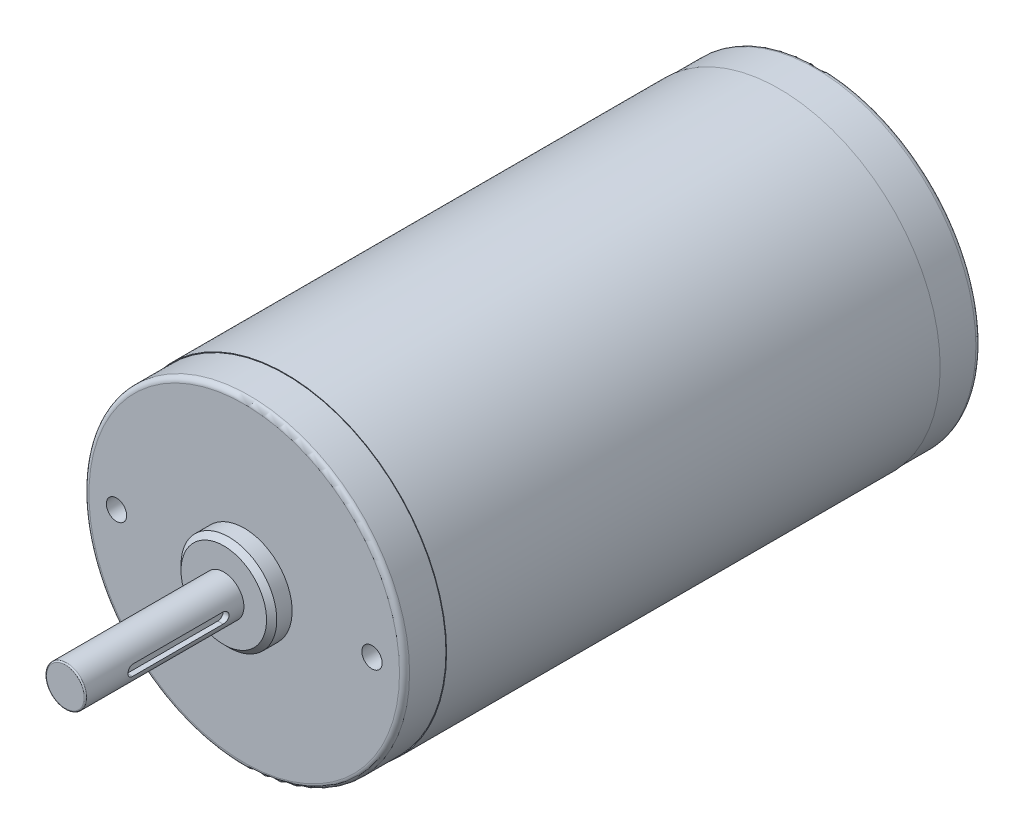
ISO-10303-21;
HEADER;
FILE_DESCRIPTION(('STEP AP214'),'2;1');
FILE_NAME('part.step','',(''),(''),'','','');
FILE_SCHEMA(('AUTOMOTIVE_DESIGN { 1 0 10303 214 1 1 1 1 }'));
ENDSEC;
DATA;
#1=APPLICATION_CONTEXT('core data for automotive mechanical design processes');
#2=APPLICATION_PROTOCOL_DEFINITION('international standard','automotive_design',2000,#1);
#3=PRODUCT_CONTEXT('',#1,'mechanical');
#4=PRODUCT('Part','Part','',(#3));
#5=PRODUCT_RELATED_PRODUCT_CATEGORY('part','',(#4));
#6=PRODUCT_DEFINITION_FORMATION('','',#4);
#7=PRODUCT_DEFINITION_CONTEXT('part definition',#1,'design');
#8=PRODUCT_DEFINITION('design','',#6,#7);
#9=PRODUCT_DEFINITION_SHAPE('','',#8);
#10=(LENGTH_UNIT() NAMED_UNIT(*) SI_UNIT(.MILLI.,.METRE.));
#11=(NAMED_UNIT(*) PLANE_ANGLE_UNIT() SI_UNIT($,.RADIAN.));
#12=(NAMED_UNIT(*) SI_UNIT($,.STERADIAN.) SOLID_ANGLE_UNIT());
#13=UNCERTAINTY_MEASURE_WITH_UNIT(LENGTH_MEASURE(1.E-05),#10,'distance_accuracy_value','');
#14=(GEOMETRIC_REPRESENTATION_CONTEXT(3) GLOBAL_UNCERTAINTY_ASSIGNED_CONTEXT((#13)) GLOBAL_UNIT_ASSIGNED_CONTEXT((#10,
#11,#12)) REPRESENTATION_CONTEXT('',''));
#15=CARTESIAN_POINT('',(0.,0.,0.));
#16=DIRECTION('',(0.,0.,1.));
#17=DIRECTION('',(1.,0.,0.));
#18=AXIS2_PLACEMENT_3D('',#15,#16,#17);
#19=CARTESIAN_POINT('',(35.56,109.2962,54.614));
#20=DIRECTION('',(0.,0.,1.));
#21=DIRECTION('',(1.,0.,0.));
#22=AXIS2_PLACEMENT_3D('',#19,#20,#21);
#23=PLANE('',#22);
#24=CARTESIAN_POINT('',(35.56,109.2962,54.614));
#25=DIRECTION('',(0.,0.,-1.));
#26=DIRECTION('',(1.,0.,0.));
#27=AXIS2_PLACEMENT_3D('',#24,#25,#26);
#28=CIRCLE('',#27,3.74600000000008);
#29=CARTESIAN_POINT('',(39.3060000000001,109.2962,54.614));
#30=VERTEX_POINT('',#29);
#31=EDGE_CURVE('E74',#30,#30,#28,.T.);
#32=ORIENTED_EDGE('',*,*,#31,.F.);
#33=EDGE_LOOP('',(#32));
#34=FACE_BOUND('',#33,.T.);
#35=ADVANCED_FACE('F16',(#34),#23,.T.);
#36=CARTESIAN_POINT('',(38.3600000000001,109.2962,16.4984772078548));
#37=DIRECTION('',(1.,0.,0.));
#38=DIRECTION('',(0.,0.,-1.));
#39=AXIS2_PLACEMENT_3D('',#36,#37,#38);
#40=PLANE('',#39);
#41=CARTESIAN_POINT('',(38.3600000000001,109.2962,27.1));
#42=DIRECTION('',(-1.,0.,0.));
#43=DIRECTION('',(0.,0.,1.));
#44=AXIS2_PLACEMENT_3D('',#41,#42,#43);
#45=CIRCLE('',#44,1.05);
#46=CARTESIAN_POINT('',(38.3600000000001,108.2462,27.1));
#47=VERTEX_POINT('',#46);
#48=CARTESIAN_POINT('',(38.3600000000001,110.3462,27.1));
#49=VERTEX_POINT('',#48);
#50=EDGE_CURVE('E666',#47,#49,#45,.F.);
#51=ORIENTED_EDGE('',*,*,#50,.T.);
#52=DIRECTION('',(0.,0.,1.));
#53=VECTOR('',#52,1.);
#54=CARTESIAN_POINT('',(38.3600000000001,110.3462,16.4984772078548));
#55=LINE('',#54,#53);
#56=CARTESIAN_POINT('',(38.3600000000001,110.3462,45.1));
#57=VERTEX_POINT('',#56);
#58=EDGE_CURVE('E57',#49,#57,#55,.T.);
#59=ORIENTED_EDGE('',*,*,#58,.T.);
#60=CARTESIAN_POINT('',(38.3600000000001,109.2962,45.1));
#61=DIRECTION('',(-1.,0.,0.));
#62=DIRECTION('',(0.,0.,1.));
#63=AXIS2_PLACEMENT_3D('',#60,#61,#62);
#64=CIRCLE('',#63,1.05);
#65=CARTESIAN_POINT('',(38.3600000000001,108.2462,45.1));
#66=VERTEX_POINT('',#65);
#67=EDGE_CURVE('E20',#57,#66,#64,.F.);
#68=ORIENTED_EDGE('',*,*,#67,.T.);
#69=DIRECTION('',(0.,0.,1.));
#70=VECTOR('',#69,1.);
#71=CARTESIAN_POINT('',(38.3600000000001,108.2462,16.4984772078548));
#72=LINE('',#71,#70);
#73=EDGE_CURVE('E61',#47,#66,#72,.T.);
#74=ORIENTED_EDGE('',*,*,#73,.F.);
#75=EDGE_LOOP('',(#51,#59,#68,#74));
#76=FACE_BOUND('',#75,.T.);
#77=ADVANCED_FACE('F60',(#76),#40,.T.);
#78=CARTESIAN_POINT('',(35.56,109.2962,54.36));
#79=DIRECTION('',(0.,0.,1.));
#80=DIRECTION('',(1.,0.,0.));
#81=AXIS2_PLACEMENT_3D('',#78,#79,#80);
#82=TOROIDAL_SURFACE('',#81,3.74600000000008,0.254);
#83=ORIENTED_EDGE('',*,*,#31,.T.);
#84=EDGE_LOOP('',(#83));
#85=FACE_BOUND('',#84,.T.);
#86=CARTESIAN_POINT('',(35.56,109.2962,54.36));
#87=DIRECTION('',(0.,0.,-1.));
#88=DIRECTION('',(-1.,0.,0.));
#89=AXIS2_PLACEMENT_3D('',#86,#87,#88);
#90=CIRCLE('',#89,4.00000000000007);
#91=CARTESIAN_POINT('',(31.5599999999999,109.2962,54.36));
#92=VERTEX_POINT('',#91);
#93=EDGE_CURVE('E671',#92,#92,#90,.T.);
#94=ORIENTED_EDGE('',*,*,#93,.F.);
#95=EDGE_LOOP('',(#94));
#96=FACE_BOUND('',#95,.T.);
#97=ADVANCED_FACE('F87',(#85,#96),#82,.T.);
#98=CARTESIAN_POINT('',(38.3600000000001,108.2462,16.4984772078548));
#99=DIRECTION('',(0.,1.,0.));
#100=DIRECTION('',(0.,0.,1.));
#101=AXIS2_PLACEMENT_3D('',#98,#99,#100);
#102=PLANE('',#101);
#103=DIRECTION('',(0.,0.,-1.));
#104=VECTOR('',#103,1.);
#105=CARTESIAN_POINT('',(39.4197279696891,108.2462,54.614));
#106=LINE('',#105,#104);
#107=CARTESIAN_POINT('',(39.4197279696891,108.2462,27.1));
#108=VERTEX_POINT('',#107);
#109=CARTESIAN_POINT('',(39.4197279696891,108.2462,45.1));
#110=VERTEX_POINT('',#109);
#111=EDGE_CURVE('E673',#108,#110,#106,.F.);
#112=ORIENTED_EDGE('',*,*,#111,.F.);
#113=DIRECTION('',(-1.,0.,0.));
#114=VECTOR('',#113,1.);
#115=CARTESIAN_POINT('',(38.3600000000001,108.2462,27.1));
#116=LINE('',#115,#114);
#117=EDGE_CURVE('E72',#108,#47,#116,.T.);
#118=ORIENTED_EDGE('',*,*,#117,.T.);
#119=ORIENTED_EDGE('',*,*,#73,.T.);
#120=DIRECTION('',(1.,0.,0.));
#121=VECTOR('',#120,1.);
#122=CARTESIAN_POINT('',(38.3600000000001,108.2462,45.1));
#123=LINE('',#122,#121);
#124=EDGE_CURVE('E66',#66,#110,#123,.T.);
#125=ORIENTED_EDGE('',*,*,#124,.T.);
#126=EDGE_LOOP('',(#112,#118,#119,#125));
#127=FACE_BOUND('',#126,.T.);
#128=ADVANCED_FACE('F69',(#127),#102,.T.);
#129=CARTESIAN_POINT('',(38.3600000000001,109.2962,45.1));
#130=DIRECTION('',(-1.,0.,0.));
#131=DIRECTION('',(0.,0.,1.));
#132=AXIS2_PLACEMENT_3D('',#129,#130,#131);
#133=CYLINDRICAL_SURFACE('',#132,1.05);
#134=DIRECTION('',(1.,0.,0.));
#135=VECTOR('',#134,1.);
#136=CARTESIAN_POINT('',(38.3600000000001,110.3462,45.1));
#137=LINE('',#136,#135);
#138=CARTESIAN_POINT('',(39.4197279696891,110.3462,45.1));
#139=VERTEX_POINT('',#138);
#140=EDGE_CURVE('E82',#57,#139,#137,.T.);
#141=ORIENTED_EDGE('',*,*,#140,.T.);
#142=CARTESIAN_POINT('',(39.4197279696891,108.2462,45.1));
#143=CARTESIAN_POINT('',(39.4197258950768,108.24619958975,45.1289948990377));
#144=CARTESIAN_POINT('',(39.4200551064328,108.247401772744,45.1579753771942));
#145=CARTESIAN_POINT('',(39.4213547123988,108.252193790165,45.2157185717611));
#146=CARTESIAN_POINT('',(39.4223249908093,108.255783191888,45.2444813266804));
#147=CARTESIAN_POINT('',(39.4261578920524,108.270078067236,45.3300048839447));
#148=CARTESIAN_POINT('',(39.4299428342912,108.284310457697,45.3861763507014));
#149=CARTESIAN_POINT('',(39.4395286889104,108.321713164946,45.4952257963179));
#150=CARTESIAN_POINT('',(39.445329326456,108.344882263286,45.5481042230163));
#151=CARTESIAN_POINT('',(39.4582892232805,108.399469503916,45.6492511443793));
#152=CARTESIAN_POINT('',(39.4654488628844,108.430889956344,45.6975183428654));
#153=CARTESIAN_POINT('',(39.4805119710478,108.501890363002,45.7892077701155));
#154=CARTESIAN_POINT('',(39.4884281885094,108.541632256913,45.8325024671448));
#155=CARTESIAN_POINT('',(39.5040047400555,108.627813145963,45.9119068745175));
#156=CARTESIAN_POINT('',(39.5116649818293,108.67425452566,45.9480140156475));
#157=CARTESIAN_POINT('',(39.526010604883,108.773412379805,46.0125503896214));
#158=CARTESIAN_POINT('',(39.5326785635433,108.826216831296,46.040848518688));
#159=CARTESIAN_POINT('',(39.5441298010583,108.936002054238,46.0880888400132));
#160=CARTESIAN_POINT('',(39.5489153447307,108.992977708579,46.1070422822868));
#161=CARTESIAN_POINT('',(39.5549473168842,109.091228422711,46.1306241727345));
#162=CARTESIAN_POINT('',(39.5568321627736,109.13185376544,46.1378772746766));
#163=CARTESIAN_POINT('',(39.5593590428507,109.213713896391,46.147566034752));
#164=CARTESIAN_POINT('',(39.560001100914,109.254948672889,46.1500017854335));
#165=CARTESIAN_POINT('',(39.5599984549201,109.354094261643,46.1499974942296));
#166=CARTESIAN_POINT('',(39.5587300938834,109.412021122661,46.1451938276971));
#167=CARTESIAN_POINT('',(39.5537908073877,109.526225171743,46.1261319193829));
#168=CARTESIAN_POINT('',(39.5501176251492,109.582500758305,46.1118647965529));
#169=CARTESIAN_POINT('',(39.5407752151886,109.691711041936,46.0743710095572));
#170=CARTESIAN_POINT('',(39.5351088856793,109.744650458997,46.051157349786));
#171=CARTESIAN_POINT('',(39.5223803452478,109.845880148194,45.9964722913931));
#172=CARTESIAN_POINT('',(39.5153181479083,109.894170465564,45.9650009731229));
#173=CARTESIAN_POINT('',(39.5003832391547,109.985824414736,45.8939447079381));
#174=CARTESIAN_POINT('',(39.4924970081334,110.029068444468,45.8542083308329));
#175=CARTESIAN_POINT('',(39.4768899553604,110.108363690847,45.768070017791));
#176=CARTESIAN_POINT('',(39.4691691622905,110.144413669136,45.7216669366335));
#177=CARTESIAN_POINT('',(39.4546281048764,110.208880604601,45.6225587145474));
#178=CARTESIAN_POINT('',(39.447825217303,110.237158627992,45.5697605148942));
#179=CARTESIAN_POINT('',(39.4360941322255,110.284374941225,45.4599645484902));
#180=CARTESIAN_POINT('',(39.4311644713835,110.303320524877,45.4029701015121));
#181=CARTESIAN_POINT('',(39.424947536189,110.326869937927,45.3047298343336));
#182=CARTESIAN_POINT('',(39.4230031721686,110.334106552333,45.2641375466187));
#183=CARTESIAN_POINT('',(39.4203876966156,110.343775049367,45.1823710409093));
#184=CARTESIAN_POINT('',(39.419715789786,110.346209933161,45.141197202614));
#185=CARTESIAN_POINT('',(39.4197279696891,110.3462,45.1));
#186=B_SPLINE_CURVE_WITH_KNOTS('',3,(#142,#143,#144,#145,#146,#147,#148,#149,#150,#151,#152,
#153,#154,#155,#156,#157,#158,#159,#160,#161,#162,#163,#164,#165,#166,#167,#168,#169,#170,#171,
#172,#173,#174,#175,#176,#177,#178,#179,#180,#181,#182,#183,#184,#185),.UNSPECIFIED.,.F.,.F.,(4,
2,2,2,2,2,2,2,2,2,2,2,2,2,2,2,2,2,2,2,2,4),(0.,0.0869295778834422,0.17384340328612,
0.347151826879625,0.520436629596116,0.69376999881019,0.870856390838584,1.04800596970821,
1.22797015523126,1.40771715061754,1.53136439682193,1.65500926755904,1.82853892099362,
2.0022316554156,2.17567286221397,2.34911238140169,2.52606492372393,2.70304789975981,
2.88301467869373,3.0628405797152,3.18638852057382,3.3098592173462),.UNSPECIFIED.);
#187=EDGE_CURVE('E78',#110,#139,#186,.T.);
#188=ORIENTED_EDGE('',*,*,#187,.F.);
#189=ORIENTED_EDGE('',*,*,#124,.F.);
#190=ORIENTED_EDGE('',*,*,#67,.F.);
#191=EDGE_LOOP('',(#141,#188,#189,#190));
#192=FACE_BOUND('',#191,.T.);
#193=ADVANCED_FACE('F76',(#192),#133,.F.);
#194=CARTESIAN_POINT('',(38.3600000000001,110.3462,16.4984772078548));
#195=DIRECTION('',(0.,1.,0.));
#196=DIRECTION('',(0.,0.,1.));
#197=AXIS2_PLACEMENT_3D('',#194,#195,#196);
#198=PLANE('',#197);
#199=ORIENTED_EDGE('',*,*,#140,.F.);
#200=ORIENTED_EDGE('',*,*,#58,.F.);
#201=DIRECTION('',(1.,0.,0.));
#202=VECTOR('',#201,1.);
#203=CARTESIAN_POINT('',(38.3600000000001,110.3462,27.1));
#204=LINE('',#203,#202);
#205=CARTESIAN_POINT('',(39.4197279696891,110.3462,27.1));
#206=VERTEX_POINT('',#205);
#207=EDGE_CURVE('E661',#49,#206,#204,.T.);
#208=ORIENTED_EDGE('',*,*,#207,.T.);
#209=DIRECTION('',(0.,0.,-1.));
#210=VECTOR('',#209,1.);
#211=CARTESIAN_POINT('',(39.4197279696891,110.3462,54.614));
#212=LINE('',#211,#210);
#213=EDGE_CURVE('E156',#139,#206,#212,.T.);
#214=ORIENTED_EDGE('',*,*,#213,.F.);
#215=EDGE_LOOP('',(#199,#200,#208,#214));
#216=FACE_BOUND('',#215,.T.);
#217=ADVANCED_FACE('F526',(#216),#198,.F.);
#218=CARTESIAN_POINT('',(38.3600000000001,109.2962,27.1));
#219=DIRECTION('',(-1.,0.,0.));
#220=DIRECTION('',(0.,0.,1.));
#221=AXIS2_PLACEMENT_3D('',#218,#219,#220);
#222=CYLINDRICAL_SURFACE('',#221,1.05);
#223=ORIENTED_EDGE('',*,*,#117,.F.);
#224=CARTESIAN_POINT('',(39.4197279696891,110.3462,27.1));
#225=CARTESIAN_POINT('',(39.4197258950768,110.34620041025,27.0710051009623));
#226=CARTESIAN_POINT('',(39.4200551064329,110.344998227256,27.0420246228058));
#227=CARTESIAN_POINT('',(39.4213547123988,110.340206209835,26.9842814282389));
#228=CARTESIAN_POINT('',(39.4223249908093,110.336616808112,26.9555186733196));
#229=CARTESIAN_POINT('',(39.4261578920524,110.322321932764,26.8699951160553));
#230=CARTESIAN_POINT('',(39.4299428342912,110.308089542303,26.8138236492986));
#231=CARTESIAN_POINT('',(39.4395286889104,110.270686835054,26.7047742036821));
#232=CARTESIAN_POINT('',(39.445329326456,110.247517736714,26.6518957769836));
#233=CARTESIAN_POINT('',(39.4582892232805,110.192930496084,26.5507488556207));
#234=CARTESIAN_POINT('',(39.4654488628844,110.161510043656,26.5024816571346));
#235=CARTESIAN_POINT('',(39.4805119710478,110.090509636998,26.4107922298844));
#236=CARTESIAN_POINT('',(39.4884281885094,110.050767743087,26.3674975328551));
#237=CARTESIAN_POINT('',(39.5040047400555,109.964586854037,26.2880931254825));
#238=CARTESIAN_POINT('',(39.5116649818293,109.91814547434,26.2519859843525));
#239=CARTESIAN_POINT('',(39.526010604883,109.818987620195,26.1874496103786));
#240=CARTESIAN_POINT('',(39.5326785635433,109.766183168704,26.159151481312));
#241=CARTESIAN_POINT('',(39.5441298010583,109.656397945762,26.1119111599868));
#242=CARTESIAN_POINT('',(39.5489153447307,109.599422291421,26.0929577177132));
#243=CARTESIAN_POINT('',(39.5549473168842,109.501171577289,26.0693758272655));
#244=CARTESIAN_POINT('',(39.5568321627736,109.46054623456,26.0621227253234));
#245=CARTESIAN_POINT('',(39.5593590428507,109.378686103609,26.052433965248));
#246=CARTESIAN_POINT('',(39.560001100914,109.337451327111,26.0499982145665));
#247=CARTESIAN_POINT('',(39.5599984549201,109.238305738357,26.0500025057704));
#248=CARTESIAN_POINT('',(39.5587300938834,109.180378877339,26.0548061723029));
#249=CARTESIAN_POINT('',(39.5537908073877,109.066174828257,26.0738680806171));
#250=CARTESIAN_POINT('',(39.5501176251492,109.009899241695,26.0881352034471));
#251=CARTESIAN_POINT('',(39.5407752151886,108.900688958064,26.1256289904428));
#252=CARTESIAN_POINT('',(39.5351088856793,108.847749541003,26.148842650214));
#253=CARTESIAN_POINT('',(39.5223803452478,108.746519851806,26.2035277086069));
#254=CARTESIAN_POINT('',(39.5153181479083,108.698229534436,26.2349990268771));
#255=CARTESIAN_POINT('',(39.5003832391547,108.606575585264,26.3060552920619));
#256=CARTESIAN_POINT('',(39.4924970081334,108.563331555532,26.3457916691671));
#257=CARTESIAN_POINT('',(39.4768899553604,108.484036309153,26.431929982209));
#258=CARTESIAN_POINT('',(39.4691691622905,108.447986330864,26.4783330633665));
#259=CARTESIAN_POINT('',(39.4546281048764,108.383519395399,26.5774412854526));
#260=CARTESIAN_POINT('',(39.447825217303,108.355241372008,26.6302394851058));
#261=CARTESIAN_POINT('',(39.4360941322255,108.308025058775,26.7400354515098));
#262=CARTESIAN_POINT('',(39.4311644713835,108.289079475123,26.7970298984879));
#263=CARTESIAN_POINT('',(39.424947536189,108.265530062073,26.8952701656664));
#264=CARTESIAN_POINT('',(39.4230031721686,108.258293447667,26.9358624533813));
#265=CARTESIAN_POINT('',(39.4203876966156,108.248624950633,27.0176289590907));
#266=CARTESIAN_POINT('',(39.419715789786,108.246190066839,27.058802797386));
#267=CARTESIAN_POINT('',(39.4197279696891,108.2462,27.1));
#268=B_SPLINE_CURVE_WITH_KNOTS('',3,(#224,#225,#226,#227,#228,#229,#230,#231,#232,#233,#234,
#235,#236,#237,#238,#239,#240,#241,#242,#243,#244,#245,#246,#247,#248,#249,#250,#251,#252,#253,
#254,#255,#256,#257,#258,#259,#260,#261,#262,#263,#264,#265,#266,#267),.UNSPECIFIED.,.F.,.F.,(4,
2,2,2,2,2,2,2,2,2,2,2,2,2,2,2,2,2,2,2,2,4),(0.,0.0869295778834421,0.173843403286115,
0.347151826879623,0.520436629596129,0.693769998810183,0.870856390838597,1.04800596970822,
1.22797015523126,1.40771715061752,1.53136439682191,1.65500926755904,1.8285389209936,
2.00223165541559,2.17567286221396,2.34911238140169,2.52606492372391,2.70304789975981,
2.88301467869372,3.06284057971519,3.18638852057381,3.30985921734618),.UNSPECIFIED.);
#269=EDGE_CURVE('E147',#206,#108,#268,.T.);
#270=ORIENTED_EDGE('',*,*,#269,.F.);
#271=ORIENTED_EDGE('',*,*,#207,.F.);
#272=ORIENTED_EDGE('',*,*,#50,.F.);
#273=EDGE_LOOP('',(#223,#270,#271,#272));
#274=FACE_BOUND('',#273,.T.);
#275=ADVANCED_FACE('F161',(#274),#222,.F.);
#276=CARTESIAN_POINT('',(35.56,109.2962,54.614));
#277=DIRECTION('',(0.,0.,-1.));
#278=DIRECTION('',(-1.,0.,0.));
#279=AXIS2_PLACEMENT_3D('',#276,#277,#278);
#280=CYLINDRICAL_SURFACE('',#279,4.00000000000007);
#281=ORIENTED_EDGE('',*,*,#213,.T.);
#282=ORIENTED_EDGE('',*,*,#269,.T.);
#283=ORIENTED_EDGE('',*,*,#111,.T.);
#284=ORIENTED_EDGE('',*,*,#187,.T.);
#285=EDGE_LOOP('',(#281,#282,#283,#284));
#286=FACE_BOUND('',#285,.T.);
#287=ORIENTED_EDGE('',*,*,#93,.T.);
#288=EDGE_LOOP('',(#287));
#289=FACE_BOUND('',#288,.T.);
#290=CARTESIAN_POINT('',(35.56,109.2962,23.114));
#291=DIRECTION('',(0.,0.,-1.));
#292=DIRECTION('',(-1.,0.,0.));
#293=AXIS2_PLACEMENT_3D('',#290,#291,#292);
#294=CIRCLE('',#293,4.00000000000007);
#295=CARTESIAN_POINT('',(31.5599999999999,109.2962,23.114));
#296=VERTEX_POINT('',#295);
#297=EDGE_CURVE('E144',#296,#296,#294,.T.);
#298=ORIENTED_EDGE('',*,*,#297,.F.);
#299=EDGE_LOOP('',(#298));
#300=FACE_BOUND('',#299,.T.);
#301=ADVANCED_FACE('F164',(#286,#289,#300),#280,.T.);
#302=CARTESIAN_POINT('',(35.56,109.2962,23.114));
#303=DIRECTION('',(0.,0.,1.));
#304=DIRECTION('',(1.,0.,0.));
#305=AXIS2_PLACEMENT_3D('',#302,#303,#304);
#306=PLANE('',#305);
#307=ORIENTED_EDGE('',*,*,#297,.T.);
#308=EDGE_LOOP('',(#307));
#309=FACE_BOUND('',#308,.T.);
#310=CARTESIAN_POINT('',(35.56,109.2962,23.114));
#311=DIRECTION('',(0.,0.,-1.));
#312=DIRECTION('',(-1.,0.,0.));
#313=AXIS2_PLACEMENT_3D('',#310,#311,#312);
#314=CIRCLE('',#313,8.50900000182338);
#315=CARTESIAN_POINT('',(27.0509999981766,109.2962,23.114));
#316=VERTEX_POINT('',#315);
#317=EDGE_CURVE('E141',#316,#316,#314,.T.);
#318=ORIENTED_EDGE('',*,*,#317,.F.);
#319=EDGE_LOOP('',(#318));
#320=FACE_BOUND('',#319,.T.);
#321=ADVANCED_FACE('F168',(#309,#320),#306,.T.);
#322=CARTESIAN_POINT('',(48.8853596371201,127.903290682857,-97.8026999980236));
#323=DIRECTION('',(0.,0.,-1.));
#324=DIRECTION('',(-1.,0.,0.));
#325=AXIS2_PLACEMENT_3D('',#322,#323,#324);
#326=PLANE('',#325);
#327=CARTESIAN_POINT('',(46.76735963712,127.903290682857,-97.8026999979988));
#328=DIRECTION('',(0.,0.,1.));
#329=DIRECTION('',(0.,-1.,0.));
#330=AXIS2_PLACEMENT_3D('',#327,#328,#329);
#331=CIRCLE('',#330,2.11800000003411);
#332=CARTESIAN_POINT('',(46.76735963712,125.785290682823,-97.8026999979988));
#333=VERTEX_POINT('',#332);
#334=EDGE_CURVE('E138',#333,#333,#331,.T.);
#335=ORIENTED_EDGE('',*,*,#334,.F.);
#336=EDGE_LOOP('',(#335));
#337=FACE_BOUND('',#336,.T.);
#338=ADVANCED_FACE('F173',(#337),#326,.T.);
#339=CARTESIAN_POINT('',(56.2850906808811,120.503559639096,-97.8026999980238));
#340=DIRECTION('',(0.,0.,-1.));
#341=DIRECTION('',(-1.,0.,0.));
#342=AXIS2_PLACEMENT_3D('',#339,#340,#341);
#343=PLANE('',#342);
#344=CARTESIAN_POINT('',(54.1670906808811,120.503559639096,-97.8026999980557));
#345=DIRECTION('',(0.,0.,1.));
#346=DIRECTION('',(0.,-1.,0.));
#347=AXIS2_PLACEMENT_3D('',#344,#345,#346);
#348=CIRCLE('',#347,2.11799999994966);
#349=CARTESIAN_POINT('',(54.1670906808811,118.385559639146,-97.8026999980557));
#350=VERTEX_POINT('',#349);
#351=EDGE_CURVE('E134',#350,#350,#348,.T.);
#352=ORIENTED_EDGE('',*,*,#351,.F.);
#353=EDGE_LOOP('',(#352));
#354=FACE_BOUND('',#353,.T.);
#355=ADVANCED_FACE('F177',(#354),#343,.T.);
#356=CARTESIAN_POINT('',(35.56,109.2962,-100.317299999998));
#357=DIRECTION('',(0.,0.,-1.));
#358=DIRECTION('',(-1.,0.,0.));
#359=AXIS2_PLACEMENT_3D('',#356,#357,#358);
#360=PLANE('',#359);
#361=CARTESIAN_POINT('',(35.56,109.2962,-100.317299999998));
#362=DIRECTION('',(0.,0.,1.));
#363=DIRECTION('',(-1.,0.,0.));
#364=AXIS2_PLACEMENT_3D('',#361,#362,#363);
#365=CIRCLE('',#364,14.0368000000003);
#366=CARTESIAN_POINT('',(21.5231999999997,109.2962,-100.317299999998));
#367=VERTEX_POINT('',#366);
#368=EDGE_CURVE('E137',#367,#367,#365,.T.);
#369=ORIENTED_EDGE('',*,*,#368,.F.);
#370=EDGE_LOOP('',(#369));
#371=FACE_BOUND('',#370,.T.);
#372=ADVANCED_FACE('F181',(#371),#360,.T.);
#373=CARTESIAN_POINT('',(10.1599999999994,109.2962,5.43560000011212));
#374=DIRECTION('',(0.,0.,1.));
#375=DIRECTION('',(1.,0.,0.));
#376=AXIS2_PLACEMENT_3D('',#373,#374,#375);
#377=CONICAL_SURFACE('',#376,2.01930000012817,1.02974425747654);
#378=CARTESIAN_POINT('',(10.1600000000417,109.2962,4.22228214875986));
#379=VERTEX_POINT('',#378);
#380=VERTEX_LOOP('',#379);
#381=FACE_BOUND('',#380,.T.);
#382=CARTESIAN_POINT('',(10.1599999999994,109.2962,5.4356000000007));
#383=DIRECTION('',(0.,0.,1.));
#384=DIRECTION('',(1.,0.,0.));
#385=AXIS2_PLACEMENT_3D('',#382,#383,#384);
#386=CIRCLE('',#385,2.01930000000003);
#387=CARTESIAN_POINT('',(12.1792999999994,109.2962,5.4356000000007));
#388=VERTEX_POINT('',#387);
#389=EDGE_CURVE('E227',#388,#388,#386,.T.);
#390=ORIENTED_EDGE('',*,*,#389,.T.);
#391=EDGE_LOOP('',(#390));
#392=FACE_BOUND('',#391,.T.);
#393=ADVANCED_FACE('F186',(#381,#392),#377,.F.);
#394=CARTESIAN_POINT('',(60.96,109.2962,5.43559999988474));
#395=DIRECTION('',(0.,0.,1.));
#396=DIRECTION('',(1.,0.,0.));
#397=AXIS2_PLACEMENT_3D('',#394,#395,#396);
#398=CONICAL_SURFACE('',#397,2.01929999982444,1.02974425737049);
#399=CARTESIAN_POINT('',(60.9599999998522,109.2962,4.22228214870302));
#400=VERTEX_POINT('',#399);
#401=VERTEX_LOOP('',#400);
#402=FACE_BOUND('',#401,.T.);
#403=CARTESIAN_POINT('',(60.96,109.2962,5.43560000000074));
#404=DIRECTION('',(0.,0.,1.));
#405=DIRECTION('',(1.,0.,0.));
#406=AXIS2_PLACEMENT_3D('',#403,#404,#405);
#407=CIRCLE('',#406,2.01930000000003);
#408=CARTESIAN_POINT('',(62.9793,109.2962,5.43560000000074));
#409=VERTEX_POINT('',#408);
#410=EDGE_CURVE('E230',#409,#409,#407,.T.);
#411=ORIENTED_EDGE('',*,*,#410,.T.);
#412=EDGE_LOOP('',(#411));
#413=FACE_BOUND('',#412,.T.);
#414=ADVANCED_FACE('F469',(#402,#413),#398,.F.);
#415=CARTESIAN_POINT('',(35.56,109.2962,22.0979999999996));
#416=DIRECTION('',(0.,0.,-1.));
#417=DIRECTION('',(-1.,0.,0.));
#418=AXIS2_PLACEMENT_3D('',#415,#416,#417);
#419=CONICAL_SURFACE('',#418,9.52500000000019,0.785398162500005);
#420=CARTESIAN_POINT('',(35.56,109.2962,22.0979999999996));
#421=DIRECTION('',(0.,0.,-1.));
#422=DIRECTION('',(-1.,0.,0.));
#423=AXIS2_PLACEMENT_3D('',#420,#421,#422);
#424=CIRCLE('',#423,9.52500000000019);
#425=CARTESIAN_POINT('',(26.0349999999998,109.2962,22.0979999999996));
#426=VERTEX_POINT('',#425);
#427=EDGE_CURVE('E235',#426,#426,#424,.T.);
#428=ORIENTED_EDGE('',*,*,#427,.F.);
#429=EDGE_LOOP('',(#428));
#430=FACE_BOUND('',#429,.T.);
#431=ORIENTED_EDGE('',*,*,#317,.T.);
#432=EDGE_LOOP('',(#431));
#433=FACE_BOUND('',#432,.T.);
#434=ADVANCED_FACE('F460',(#430,#433),#419,.T.);
#435=CARTESIAN_POINT('',(46.76735963712,127.903290682857,-95.6026999959931));
#436=DIRECTION('',(0.,0.,1.));
#437=DIRECTION('',(0.,-1.,0.));
#438=AXIS2_PLACEMENT_3D('',#435,#436,#437);
#439=CONICAL_SURFACE('',#438,4.31800000198298,0.785398163384529);
#440=CARTESIAN_POINT('',(46.76735963712,127.903290682857,-95.6026999960491));
#441=DIRECTION('',(0.,0.,1.));
#442=DIRECTION('',(1.,0.,0.));
#443=AXIS2_PLACEMENT_3D('',#440,#441,#442);
#444=CIRCLE('',#443,4.3180000019745);
#445=CARTESIAN_POINT('',(51.0853596390945,127.903290682857,-95.6026999960491));
#446=VERTEX_POINT('',#445);
#447=EDGE_CURVE('E240',#446,#446,#444,.T.);
#448=ORIENTED_EDGE('',*,*,#447,.F.);
#449=EDGE_LOOP('',(#448));
#450=FACE_BOUND('',#449,.T.);
#451=ORIENTED_EDGE('',*,*,#334,.T.);
#452=EDGE_LOOP('',(#451));
#453=FACE_BOUND('',#452,.T.);
#454=ADVANCED_FACE('F450',(#450,#453),#439,.T.);
#455=CARTESIAN_POINT('',(54.1670906808811,120.503559639096,-95.6026999961637));
#456=DIRECTION('',(0.,0.,1.));
#457=DIRECTION('',(0.,-1.,0.));
#458=AXIS2_PLACEMENT_3D('',#455,#456,#457);
#459=CONICAL_SURFACE('',#458,4.31800000184168,0.785398163397448);
#460=CARTESIAN_POINT('',(54.1670906808811,120.503559639096,-95.6026999960494));
#461=DIRECTION('',(0.,0.,1.));
#462=DIRECTION('',(1.,0.,0.));
#463=AXIS2_PLACEMENT_3D('',#460,#461,#462);
#464=CIRCLE('',#463,4.31800000197446);
#465=CARTESIAN_POINT('',(58.4850906828556,120.503559639096,-95.6026999960494));
#466=VERTEX_POINT('',#465);
#467=EDGE_CURVE('E245',#466,#466,#464,.T.);
#468=ORIENTED_EDGE('',*,*,#467,.F.);
#469=EDGE_LOOP('',(#468));
#470=FACE_BOUND('',#469,.T.);
#471=ORIENTED_EDGE('',*,*,#351,.T.);
#472=EDGE_LOOP('',(#471));
#473=FACE_BOUND('',#472,.T.);
#474=ADVANCED_FACE('F220',(#470,#473),#459,.T.);
#475=CARTESIAN_POINT('',(35.56,109.2962,-99.317299999998));
#476=DIRECTION('',(0.,0.,-1.));
#477=DIRECTION('',(-1.,0.,0.));
#478=AXIS2_PLACEMENT_3D('',#475,#476,#477);
#479=TOROIDAL_SURFACE('',#478,14.0368000000003,1.);
#480=ORIENTED_EDGE('',*,*,#368,.T.);
#481=EDGE_LOOP('',(#480));
#482=FACE_BOUND('',#481,.T.);
#483=CARTESIAN_POINT('',(35.56,109.2962,-99.317299999998));
#484=DIRECTION('',(0.,0.,1.));
#485=DIRECTION('',(1.,0.,0.));
#486=AXIS2_PLACEMENT_3D('',#483,#484,#485);
#487=CIRCLE('',#486,15.0368000000003);
#488=CARTESIAN_POINT('',(50.5968000000003,109.2962,-99.317299999998));
#489=VERTEX_POINT('',#488);
#490=EDGE_CURVE('E133',#489,#489,#487,.T.);
#491=ORIENTED_EDGE('',*,*,#490,.F.);
#492=EDGE_LOOP('',(#491));
#493=FACE_BOUND('',#492,.T.);
#494=ADVANCED_FACE('F209',(#482,#493),#479,.T.);
#495=CARTESIAN_POINT('',(10.1599999999994,109.2962,19.05));
#496=DIRECTION('',(0.,0.,1.));
#497=DIRECTION('',(1.,0.,0.));
#498=AXIS2_PLACEMENT_3D('',#495,#496,#497);
#499=CYLINDRICAL_SURFACE('',#498,2.01930000000003);
#500=CARTESIAN_POINT('',(10.1599999999994,109.2962,19.05));
#501=DIRECTION('',(0.,0.,1.));
#502=DIRECTION('',(1.,0.,0.));
#503=AXIS2_PLACEMENT_3D('',#500,#501,#502);
#504=CIRCLE('',#503,2.01930000000003);
#505=CARTESIAN_POINT('',(12.1792999999994,109.2962,19.05));
#506=VERTEX_POINT('',#505);
#507=EDGE_CURVE('E130',#506,#506,#504,.F.);
#508=ORIENTED_EDGE('',*,*,#507,.F.);
#509=EDGE_LOOP('',(#508));
#510=FACE_BOUND('',#509,.T.);
#511=ORIENTED_EDGE('',*,*,#389,.F.);
#512=EDGE_LOOP('',(#511));
#513=FACE_BOUND('',#512,.T.);
#514=ADVANCED_FACE('F219',(#510,#513),#499,.F.);
#515=CARTESIAN_POINT('',(60.96,109.2962,19.05));
#516=DIRECTION('',(0.,0.,1.));
#517=DIRECTION('',(1.,0.,0.));
#518=AXIS2_PLACEMENT_3D('',#515,#516,#517);
#519=CYLINDRICAL_SURFACE('',#518,2.01930000000003);
#520=CARTESIAN_POINT('',(60.96,109.2962,19.05));
#521=DIRECTION('',(0.,0.,1.));
#522=DIRECTION('',(1.,0.,0.));
#523=AXIS2_PLACEMENT_3D('',#520,#521,#522);
#524=CIRCLE('',#523,2.01930000000003);
#525=CARTESIAN_POINT('',(62.9793,109.2962,19.05));
#526=VERTEX_POINT('',#525);
#527=EDGE_CURVE('E127',#526,#526,#524,.F.);
#528=ORIENTED_EDGE('',*,*,#527,.F.);
#529=EDGE_LOOP('',(#528));
#530=FACE_BOUND('',#529,.T.);
#531=ORIENTED_EDGE('',*,*,#410,.F.);
#532=EDGE_LOOP('',(#531));
#533=FACE_BOUND('',#532,.T.);
#534=ADVANCED_FACE('F334',(#530,#533),#519,.F.);
#535=CARTESIAN_POINT('',(35.56,109.2962,23.114));
#536=DIRECTION('',(0.,0.,-1.));
#537=DIRECTION('',(-1.,0.,0.));
#538=AXIS2_PLACEMENT_3D('',#535,#536,#537);
#539=CYLINDRICAL_SURFACE('',#538,9.52500000000019);
#540=CARTESIAN_POINT('',(35.56,109.2962,19.05));
#541=DIRECTION('',(0.,0.,-1.));
#542=DIRECTION('',(-1.,0.,0.));
#543=AXIS2_PLACEMENT_3D('',#540,#541,#542);
#544=CIRCLE('',#543,9.52500000000019);
#545=CARTESIAN_POINT('',(26.0349999999998,109.2962,19.05));
#546=VERTEX_POINT('',#545);
#547=EDGE_CURVE('E124',#546,#546,#544,.T.);
#548=ORIENTED_EDGE('',*,*,#547,.F.);
#549=EDGE_LOOP('',(#548));
#550=FACE_BOUND('',#549,.T.);
#551=ORIENTED_EDGE('',*,*,#427,.T.);
#552=EDGE_LOOP('',(#551));
#553=FACE_BOUND('',#552,.T.);
#554=ADVANCED_FACE('F331',(#550,#553),#539,.T.);
#555=CARTESIAN_POINT('',(46.76735963712,127.903290682857,-97.8026999980236));
#556=DIRECTION('',(0.,0.,1.));
#557=DIRECTION('',(1.,0.,0.));
#558=AXIS2_PLACEMENT_3D('',#555,#556,#557);
#559=CYLINDRICAL_SURFACE('',#558,4.3180000019745);
#560=CARTESIAN_POINT('',(46.76735963712,127.903290682857,-95.554799999998));
#561=DIRECTION('',(0.,0.,1.));
#562=DIRECTION('',(1.,0.,0.));
#563=AXIS2_PLACEMENT_3D('',#560,#561,#562);
#564=CIRCLE('',#563,4.3180000019745);
#565=CARTESIAN_POINT('',(51.0853596390945,127.903290682857,-95.554799999998));
#566=VERTEX_POINT('',#565);
#567=EDGE_CURVE('E121',#566,#566,#564,.T.);
#568=ORIENTED_EDGE('',*,*,#567,.F.);
#569=EDGE_LOOP('',(#568));
#570=FACE_BOUND('',#569,.T.);
#571=ORIENTED_EDGE('',*,*,#447,.T.);
#572=EDGE_LOOP('',(#571));
#573=FACE_BOUND('',#572,.T.);
#574=ADVANCED_FACE('F327',(#570,#573),#559,.T.);
#575=CARTESIAN_POINT('',(54.1670906808811,120.503559639096,-97.8026999980238));
#576=DIRECTION('',(0.,0.,1.));
#577=DIRECTION('',(1.,0.,0.));
#578=AXIS2_PLACEMENT_3D('',#575,#576,#577);
#579=CYLINDRICAL_SURFACE('',#578,4.31800000197446);
#580=CARTESIAN_POINT('',(54.1670906808811,120.503559639096,-95.554799999998));
#581=DIRECTION('',(0.,0.,1.));
#582=DIRECTION('',(1.,0.,0.));
#583=AXIS2_PLACEMENT_3D('',#580,#581,#582);
#584=CIRCLE('',#583,4.31800000197446);
#585=CARTESIAN_POINT('',(58.4850906828556,120.503559639096,-95.554799999998));
#586=VERTEX_POINT('',#585);
#587=EDGE_CURVE('E118',#586,#586,#584,.T.);
#588=ORIENTED_EDGE('',*,*,#587,.F.);
#589=EDGE_LOOP('',(#588));
#590=FACE_BOUND('',#589,.T.);
#591=ORIENTED_EDGE('',*,*,#467,.T.);
#592=EDGE_LOOP('',(#591));
#593=FACE_BOUND('',#592,.T.);
#594=ADVANCED_FACE('F323',(#590,#593),#579,.T.);
#595=CARTESIAN_POINT('',(35.56,109.2962,-100.317299999998));
#596=DIRECTION('',(0.,0.,1.));
#597=DIRECTION('',(1.,0.,0.));
#598=AXIS2_PLACEMENT_3D('',#595,#596,#597);
#599=CYLINDRICAL_SURFACE('',#598,15.0368000000003);
#600=CARTESIAN_POINT('',(35.56,109.2962,-95.554799999998));
#601=DIRECTION('',(0.,0.,1.));
#602=DIRECTION('',(1.,0.,0.));
#603=AXIS2_PLACEMENT_3D('',#600,#601,#602);
#604=CIRCLE('',#603,15.0368000000003);
#605=CARTESIAN_POINT('',(50.5968000000003,109.2962,-95.554799999998));
#606=VERTEX_POINT('',#605);
#607=EDGE_CURVE('E114',#606,#606,#604,.T.);
#608=ORIENTED_EDGE('',*,*,#607,.F.);
#609=EDGE_LOOP('',(#608));
#610=FACE_BOUND('',#609,.T.);
#611=ORIENTED_EDGE('',*,*,#490,.T.);
#612=EDGE_LOOP('',(#611));
#613=FACE_BOUND('',#612,.T.);
#614=ADVANCED_FACE('F319',(#610,#613),#599,.T.);
#615=CARTESIAN_POINT('',(35.56,109.2962,19.05));
#616=DIRECTION('',(0.,0.,1.));
#617=DIRECTION('',(1.,0.,0.));
#618=AXIS2_PLACEMENT_3D('',#615,#616,#617);
#619=PLANE('',#618);
#620=ORIENTED_EDGE('',*,*,#547,.T.);
#621=EDGE_LOOP('',(#620));
#622=FACE_BOUND('',#621,.T.);
#623=ORIENTED_EDGE('',*,*,#527,.T.);
#624=EDGE_LOOP('',(#623));
#625=FACE_BOUND('',#624,.T.);
#626=ORIENTED_EDGE('',*,*,#507,.T.);
#627=EDGE_LOOP('',(#626));
#628=FACE_BOUND('',#627,.T.);
#629=CARTESIAN_POINT('',(35.56,109.2962,19.05));
#630=DIRECTION('',(0.,0.,-1.));
#631=DIRECTION('',(1.,0.,0.));
#632=AXIS2_PLACEMENT_3D('',#629,#630,#631);
#633=CIRCLE('',#632,30.8770000000005);
#634=CARTESIAN_POINT('',(66.4370000000005,109.2962,19.05));
#635=VERTEX_POINT('',#634);
#636=EDGE_CURVE('E117',#635,#635,#633,.T.);
#637=ORIENTED_EDGE('',*,*,#636,.F.);
#638=EDGE_LOOP('',(#637));
#639=FACE_BOUND('',#638,.T.);
#640=ADVANCED_FACE('F310',(#622,#625,#628,#639),#619,.T.);
#641=CARTESIAN_POINT('',(35.56,109.2962,-95.554799999998));
#642=DIRECTION('',(0.,0.,-1.));
#643=DIRECTION('',(-1.,0.,0.));
#644=AXIS2_PLACEMENT_3D('',#641,#642,#643);
#645=PLANE('',#644);
#646=ORIENTED_EDGE('',*,*,#607,.T.);
#647=EDGE_LOOP('',(#646));
#648=FACE_BOUND('',#647,.T.);
#649=ORIENTED_EDGE('',*,*,#587,.T.);
#650=EDGE_LOOP('',(#649));
#651=FACE_BOUND('',#650,.T.);
#652=ORIENTED_EDGE('',*,*,#567,.T.);
#653=EDGE_LOOP('',(#652));
#654=FACE_BOUND('',#653,.T.);
#655=CARTESIAN_POINT('',(35.56,109.2962,-95.554799999998));
#656=DIRECTION('',(0.,0.,1.));
#657=DIRECTION('',(-1.,0.,0.));
#658=AXIS2_PLACEMENT_3D('',#655,#656,#657);
#659=CIRCLE('',#658,30.8770000000005);
#660=CARTESIAN_POINT('',(4.6829999999995,109.2962,-95.554799999998));
#661=VERTEX_POINT('',#660);
#662=EDGE_CURVE('E287',#661,#661,#659,.T.);
#663=ORIENTED_EDGE('',*,*,#662,.F.);
#664=EDGE_LOOP('',(#663));
#665=FACE_BOUND('',#664,.T.);
#666=ADVANCED_FACE('F272',(#648,#651,#654,#665),#645,.T.);
#667=CARTESIAN_POINT('',(35.56,109.2962,18.05));
#668=DIRECTION('',(0.,0.,1.));
#669=DIRECTION('',(1.,0.,0.));
#670=AXIS2_PLACEMENT_3D('',#667,#668,#669);
#671=TOROIDAL_SURFACE('',#670,30.8770000000005,1.);
#672=ORIENTED_EDGE('',*,*,#636,.T.);
#673=EDGE_LOOP('',(#672));
#674=FACE_BOUND('',#673,.T.);
#675=CARTESIAN_POINT('',(35.56,109.2962,18.05));
#676=DIRECTION('',(0.,0.,-1.));
#677=DIRECTION('',(-1.,0.,0.));
#678=AXIS2_PLACEMENT_3D('',#675,#676,#677);
#679=CIRCLE('',#678,31.8770000000005);
#680=CARTESIAN_POINT('',(3.6829999999995,109.2962,18.05));
#681=VERTEX_POINT('',#680);
#682=EDGE_CURVE('E374',#681,#681,#679,.T.);
#683=ORIENTED_EDGE('',*,*,#682,.F.);
#684=EDGE_LOOP('',(#683));
#685=FACE_BOUND('',#684,.T.);
#686=ADVANCED_FACE('F260',(#674,#685),#671,.T.);
#687=CARTESIAN_POINT('',(35.56,109.2962,-94.554799999998));
#688=DIRECTION('',(0.,0.,-1.));
#689=DIRECTION('',(-1.,0.,0.));
#690=AXIS2_PLACEMENT_3D('',#687,#688,#689);
#691=TOROIDAL_SURFACE('',#690,30.8770000000005,1.);
#692=ORIENTED_EDGE('',*,*,#662,.T.);
#693=EDGE_LOOP('',(#692));
#694=FACE_BOUND('',#693,.T.);
#695=CARTESIAN_POINT('',(35.56,109.2962,-94.554799999998));
#696=DIRECTION('',(0.,0.,1.));
#697=DIRECTION('',(1.,0.,0.));
#698=AXIS2_PLACEMENT_3D('',#695,#696,#697);
#699=CIRCLE('',#698,31.8770000000005);
#700=CARTESIAN_POINT('',(67.4370000000005,109.2962,-94.554799999998));
#701=VERTEX_POINT('',#700);
#702=EDGE_CURVE('E113',#701,#701,#699,.T.);
#703=ORIENTED_EDGE('',*,*,#702,.F.);
#704=EDGE_LOOP('',(#703));
#705=FACE_BOUND('',#704,.T.);
#706=ADVANCED_FACE('F271',(#694,#705),#691,.T.);
#707=CARTESIAN_POINT('',(35.56,109.2962,19.05));
#708=DIRECTION('',(0.,0.,-1.));
#709=DIRECTION('',(-1.,0.,0.));
#710=AXIS2_PLACEMENT_3D('',#707,#708,#709);
#711=CYLINDRICAL_SURFACE('',#710,31.8770000000005);
#712=CARTESIAN_POINT('',(35.56,109.2962,10.8204000000007));
#713=DIRECTION('',(0.,0.,-1.));
#714=DIRECTION('',(-1.,0.,0.));
#715=AXIS2_PLACEMENT_3D('',#712,#713,#714);
#716=CIRCLE('',#715,31.8770000000005);
#717=CARTESIAN_POINT('',(3.6829999999995,109.2962,10.8204000000007));
#718=VERTEX_POINT('',#717);
#719=EDGE_CURVE('E110',#718,#718,#716,.T.);
#720=ORIENTED_EDGE('',*,*,#719,.F.);
#721=EDGE_LOOP('',(#720));
#722=FACE_BOUND('',#721,.T.);
#723=ORIENTED_EDGE('',*,*,#682,.T.);
#724=EDGE_LOOP('',(#723));
#725=FACE_BOUND('',#724,.T.);
#726=ADVANCED_FACE('F363',(#722,#725),#711,.T.);
#727=CARTESIAN_POINT('',(35.56,109.2962,-95.554799999998));
#728=DIRECTION('',(0.,0.,1.));
#729=DIRECTION('',(1.,0.,0.));
#730=AXIS2_PLACEMENT_3D('',#727,#728,#729);
#731=CYLINDRICAL_SURFACE('',#730,31.8770000000005);
#732=CARTESIAN_POINT('',(35.56,109.2962,-87.325199999998));
#733=DIRECTION('',(0.,0.,1.));
#734=DIRECTION('',(1.,0.,0.));
#735=AXIS2_PLACEMENT_3D('',#732,#733,#734);
#736=CIRCLE('',#735,31.8770000000005);
#737=CARTESIAN_POINT('',(67.4370000000005,109.2962,-87.325199999998));
#738=VERTEX_POINT('',#737);
#739=EDGE_CURVE('E107',#738,#738,#736,.T.);
#740=ORIENTED_EDGE('',*,*,#739,.F.);
#741=EDGE_LOOP('',(#740));
#742=FACE_BOUND('',#741,.T.);
#743=ORIENTED_EDGE('',*,*,#702,.T.);
#744=EDGE_LOOP('',(#743));
#745=FACE_BOUND('',#744,.T.);
#746=ADVANCED_FACE('F360',(#742,#745),#731,.T.);
#747=CARTESIAN_POINT('',(67.5640000000005,109.2962,10.8204000000007));
#748=DIRECTION('',(0.,0.,1.));
#749=DIRECTION('',(1.,0.,0.));
#750=AXIS2_PLACEMENT_3D('',#747,#748,#749);
#751=PLANE('',#750);
#752=ORIENTED_EDGE('',*,*,#719,.T.);
#753=EDGE_LOOP('',(#752));
#754=FACE_BOUND('',#753,.T.);
#755=CARTESIAN_POINT('',(35.56,109.2962,10.8204000000007));
#756=DIRECTION('',(0.,0.,-1.));
#757=DIRECTION('',(-1.,0.,0.));
#758=AXIS2_PLACEMENT_3D('',#755,#756,#757);
#759=CIRCLE('',#758,32.0040000000005);
#760=CARTESIAN_POINT('',(3.5559999999995,109.2962,10.8204000000007));
#761=VERTEX_POINT('',#760);
#762=EDGE_CURVE('E26',#761,#761,#759,.T.);
#763=ORIENTED_EDGE('',*,*,#762,.F.);
#764=EDGE_LOOP('',(#763));
#765=FACE_BOUND('',#764,.T.);
#766=ADVANCED_FACE('F353',(#754,#765),#751,.T.);
#767=CARTESIAN_POINT('',(35.56,109.2962,-87.325199999998));
#768=DIRECTION('',(0.,0.,-1.));
#769=DIRECTION('',(-1.,0.,0.));
#770=AXIS2_PLACEMENT_3D('',#767,#768,#769);
#771=PLANE('',#770);
#772=ORIENTED_EDGE('',*,*,#739,.T.);
#773=EDGE_LOOP('',(#772));
#774=FACE_BOUND('',#773,.T.);
#775=CARTESIAN_POINT('',(35.56,109.2962,-87.325199999998));
#776=DIRECTION('',(0.,0.,-1.));
#777=DIRECTION('',(-1.,0.,0.));
#778=AXIS2_PLACEMENT_3D('',#775,#776,#777);
#779=CIRCLE('',#778,32.0040000000005);
#780=CARTESIAN_POINT('',(3.5559999999995,109.2962,-87.325199999998));
#781=VERTEX_POINT('',#780);
#782=EDGE_CURVE('E11',#781,#781,#779,.F.);
#783=ORIENTED_EDGE('',*,*,#782,.F.);
#784=EDGE_LOOP('',(#783));
#785=FACE_BOUND('',#784,.T.);
#786=ADVANCED_FACE('F347',(#774,#785),#771,.T.);
#787=CARTESIAN_POINT('',(35.56,109.2962,10.8204000000007));
#788=DIRECTION('',(0.,0.,-1.));
#789=DIRECTION('',(-1.,0.,0.));
#790=AXIS2_PLACEMENT_3D('',#787,#788,#789);
#791=CYLINDRICAL_SURFACE('',#790,32.0040000000005);
#792=ORIENTED_EDGE('',*,*,#782,.T.);
#793=EDGE_LOOP('',(#792));
#794=FACE_BOUND('',#793,.T.);
#795=ORIENTED_EDGE('',*,*,#762,.T.);
#796=EDGE_LOOP('',(#795));
#797=FACE_BOUND('',#796,.T.);
#798=ADVANCED_FACE('F345',(#794,#797),#791,.T.);
#799=CLOSED_SHELL('',(#35,#77,#97,#128,#193,#217,#275,#301,#321,#338,#355,#372,#393,#414,#434,
#454,#474,#494,#514,#534,#554,#574,#594,#614,#640,#666,#686,#706,#726,#746,#766,#786,#798));
#800=MANIFOLD_SOLID_BREP('B1',#799);
#801=ADVANCED_BREP_SHAPE_REPRESENTATION('',(#18,#800),#14);
#802=SHAPE_DEFINITION_REPRESENTATION(#9,#801);
ENDSEC;
END-ISO-10303-21;
